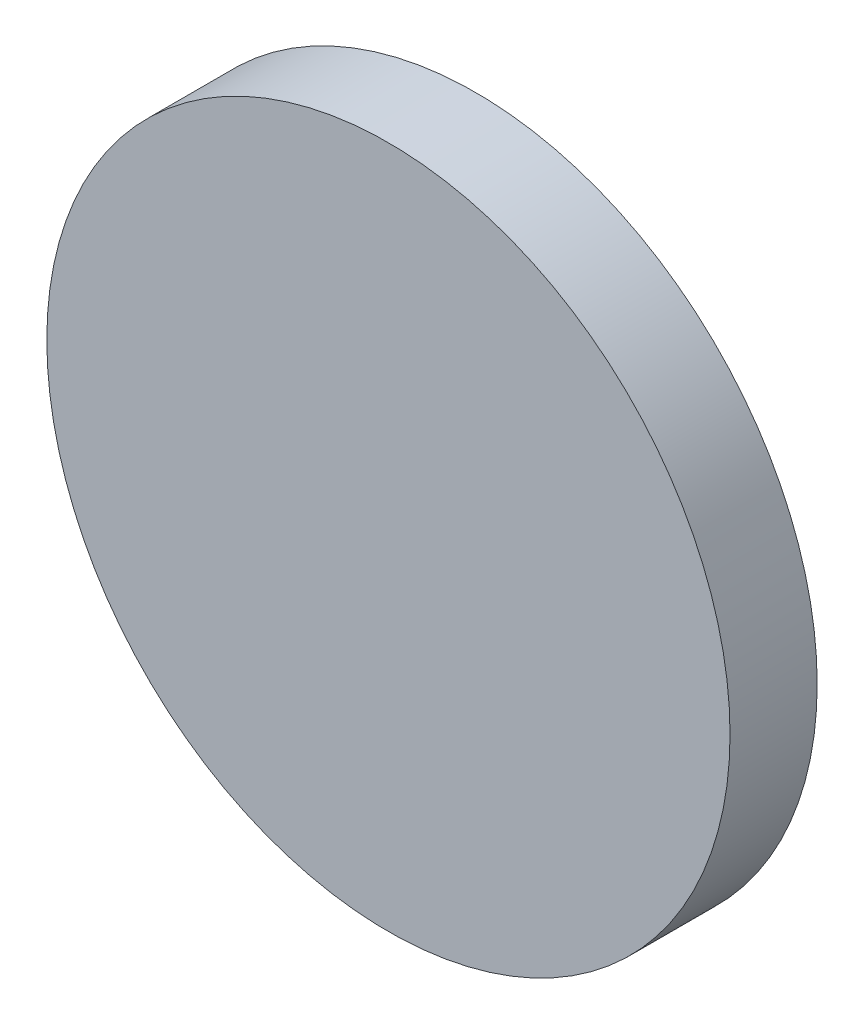
ISO-10303-21;
HEADER;
FILE_DESCRIPTION(('STEP AP214'),'2;1');
FILE_NAME('part.step','',(''),(''),'','','');
FILE_SCHEMA(('AUTOMOTIVE_DESIGN { 1 0 10303 214 1 1 1 1 }'));
ENDSEC;
DATA;
#1=APPLICATION_CONTEXT('core data for automotive mechanical design processes');
#2=APPLICATION_PROTOCOL_DEFINITION('international standard','automotive_design',2000,#1);
#3=PRODUCT_CONTEXT('',#1,'mechanical');
#4=PRODUCT('Part','Part','',(#3));
#5=PRODUCT_RELATED_PRODUCT_CATEGORY('part','',(#4));
#6=PRODUCT_DEFINITION_FORMATION('','',#4);
#7=PRODUCT_DEFINITION_CONTEXT('part definition',#1,'design');
#8=PRODUCT_DEFINITION('design','',#6,#7);
#9=PRODUCT_DEFINITION_SHAPE('','',#8);
#10=(LENGTH_UNIT() NAMED_UNIT(*) SI_UNIT(.MILLI.,.METRE.));
#11=(NAMED_UNIT(*) PLANE_ANGLE_UNIT() SI_UNIT($,.RADIAN.));
#12=(NAMED_UNIT(*) SI_UNIT($,.STERADIAN.) SOLID_ANGLE_UNIT());
#13=UNCERTAINTY_MEASURE_WITH_UNIT(LENGTH_MEASURE(1.E-05),#10,'distance_accuracy_value','');
#14=(GEOMETRIC_REPRESENTATION_CONTEXT(3) GLOBAL_UNCERTAINTY_ASSIGNED_CONTEXT((#13)) GLOBAL_UNIT_ASSIGNED_CONTEXT((#10,
#11,#12)) REPRESENTATION_CONTEXT('',''));
#15=CARTESIAN_POINT('',(0.,0.,0.));
#16=DIRECTION('',(0.,0.,1.));
#17=DIRECTION('',(1.,0.,0.));
#18=AXIS2_PLACEMENT_3D('',#15,#16,#17);
#19=CARTESIAN_POINT('',(0.,0.,3.175));
#20=DIRECTION('',(0.,0.,-1.));
#21=DIRECTION('',(-1.,0.,0.));
#22=AXIS2_PLACEMENT_3D('',#19,#20,#21);
#23=CYLINDRICAL_SURFACE('',#22,12.446);
#24=CARTESIAN_POINT('',(0.,0.,3.175));
#25=DIRECTION('',(0.,0.,1.));
#26=DIRECTION('',(1.,0.,0.));
#27=AXIS2_PLACEMENT_3D('',#24,#25,#26);
#28=CIRCLE('',#27,12.446);
#29=CARTESIAN_POINT('',(12.446,0.,3.175));
#30=VERTEX_POINT('',#29);
#31=EDGE_CURVE('E10',#30,#30,#28,.T.);
#32=ORIENTED_EDGE('',*,*,#31,.F.);
#33=EDGE_LOOP('',(#32));
#34=FACE_BOUND('',#33,.T.);
#35=CARTESIAN_POINT('',(0.,0.,0.));
#36=DIRECTION('',(0.,0.,1.));
#37=DIRECTION('',(1.,0.,0.));
#38=AXIS2_PLACEMENT_3D('',#35,#36,#37);
#39=CIRCLE('',#38,12.446);
#40=CARTESIAN_POINT('',(12.446,0.,0.));
#41=VERTEX_POINT('',#40);
#42=EDGE_CURVE('E34',#41,#41,#39,.T.);
#43=ORIENTED_EDGE('',*,*,#42,.T.);
#44=EDGE_LOOP('',(#43));
#45=FACE_BOUND('',#44,.T.);
#46=ADVANCED_FACE('F31',(#34,#45),#23,.T.);
#47=CARTESIAN_POINT('',(0.,0.,3.175));
#48=DIRECTION('',(0.,0.,1.));
#49=DIRECTION('',(1.,0.,0.));
#50=AXIS2_PLACEMENT_3D('',#47,#48,#49);
#51=PLANE('',#50);
#52=ORIENTED_EDGE('',*,*,#31,.T.);
#53=EDGE_LOOP('',(#52));
#54=FACE_BOUND('',#53,.T.);
#55=ADVANCED_FACE('F46',(#54),#51,.T.);
#56=CARTESIAN_POINT('',(0.,0.,0.));
#57=DIRECTION('',(0.,0.,1.));
#58=DIRECTION('',(1.,0.,0.));
#59=AXIS2_PLACEMENT_3D('',#56,#57,#58);
#60=PLANE('',#59);
#61=ORIENTED_EDGE('',*,*,#42,.F.);
#62=EDGE_LOOP('',(#61));
#63=FACE_BOUND('',#62,.T.);
#64=ADVANCED_FACE('F44',(#63),#60,.F.);
#65=CLOSED_SHELL('',(#46,#55,#64));
#66=MANIFOLD_SOLID_BREP('B2',#65);
#67=ADVANCED_BREP_SHAPE_REPRESENTATION('',(#18,#66),#14);
#68=SHAPE_DEFINITION_REPRESENTATION(#9,#67);
ENDSEC;
END-ISO-10303-21;
